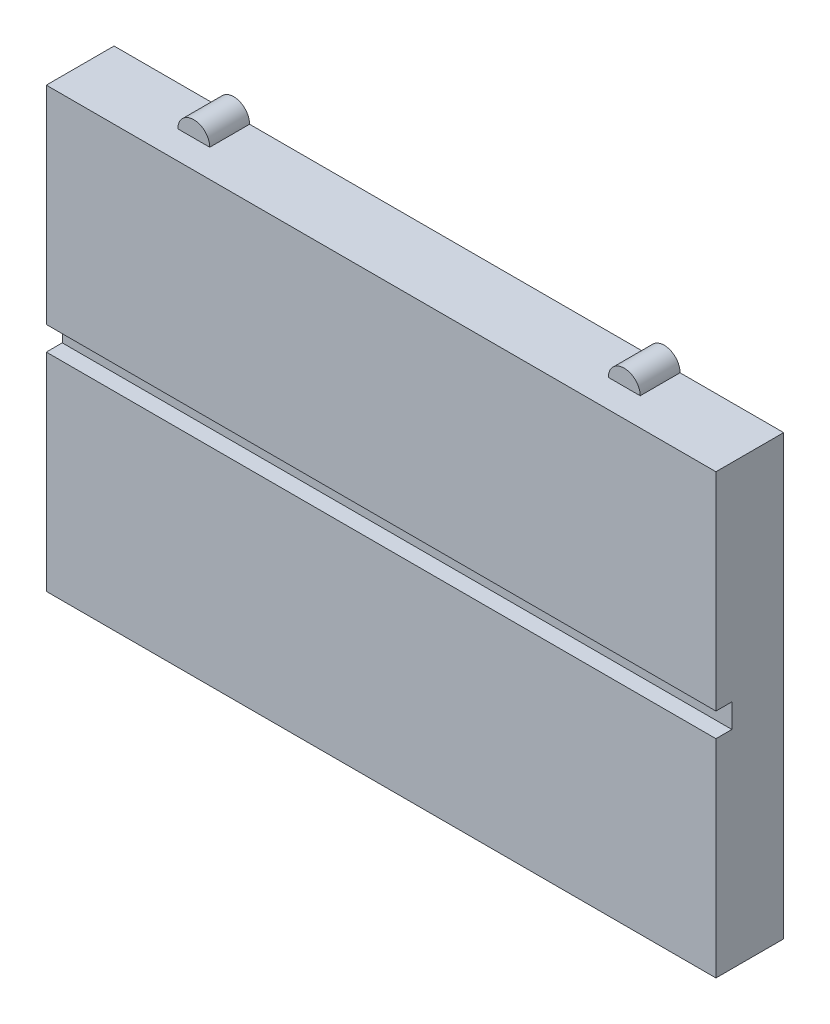
ISO-10303-21;
HEADER;
FILE_DESCRIPTION(('STEP AP214'),'2;1');
FILE_NAME('part.step','',(''),(''),'','','');
FILE_SCHEMA(('AUTOMOTIVE_DESIGN { 1 0 10303 214 1 1 1 1 }'));
ENDSEC;
DATA;
#1=APPLICATION_CONTEXT('core data for automotive mechanical design processes');
#2=APPLICATION_PROTOCOL_DEFINITION('international standard','automotive_design',2000,#1);
#3=PRODUCT_CONTEXT('',#1,'mechanical');
#4=PRODUCT('Part','Part','',(#3));
#5=PRODUCT_RELATED_PRODUCT_CATEGORY('part','',(#4));
#6=PRODUCT_DEFINITION_FORMATION('','',#4);
#7=PRODUCT_DEFINITION_CONTEXT('part definition',#1,'design');
#8=PRODUCT_DEFINITION('design','',#6,#7);
#9=PRODUCT_DEFINITION_SHAPE('','',#8);
#10=(LENGTH_UNIT() NAMED_UNIT(*) SI_UNIT(.MILLI.,.METRE.));
#11=(NAMED_UNIT(*) PLANE_ANGLE_UNIT() SI_UNIT($,.RADIAN.));
#12=(NAMED_UNIT(*) SI_UNIT($,.STERADIAN.) SOLID_ANGLE_UNIT());
#13=UNCERTAINTY_MEASURE_WITH_UNIT(LENGTH_MEASURE(1.E-05),#10,'distance_accuracy_value','');
#14=(GEOMETRIC_REPRESENTATION_CONTEXT(3) GLOBAL_UNCERTAINTY_ASSIGNED_CONTEXT((#13)) GLOBAL_UNIT_ASSIGNED_CONTEXT((#10,
#11,#12)) REPRESENTATION_CONTEXT('',''));
#15=CARTESIAN_POINT('',(0.,0.,0.));
#16=DIRECTION('',(0.,0.,1.));
#17=DIRECTION('',(1.,0.,0.));
#18=AXIS2_PLACEMENT_3D('',#15,#16,#17);
#19=CARTESIAN_POINT('',(0.,0.,8.5));
#20=DIRECTION('',(0.,0.,1.));
#21=DIRECTION('',(1.,0.,0.));
#22=AXIS2_PLACEMENT_3D('',#19,#20,#21);
#23=PLANE('',#22);
#24=DIRECTION('',(-1.,0.,0.));
#25=VECTOR('',#24,1.);
#26=CARTESIAN_POINT('',(42.,1.5,8.5));
#27=LINE('',#26,#25);
#28=CARTESIAN_POINT('',(42.,1.5,8.5));
#29=VERTEX_POINT('',#28);
#30=CARTESIAN_POINT('',(-42.,1.5,8.5));
#31=VERTEX_POINT('',#30);
#32=EDGE_CURVE('E189',#29,#31,#27,.T.);
#33=ORIENTED_EDGE('',*,*,#32,.F.);
#34=DIRECTION('',(0.,1.,0.));
#35=VECTOR('',#34,1.);
#36=CARTESIAN_POINT('',(42.,0.,8.5));
#37=LINE('',#36,#35);
#38=CARTESIAN_POINT('',(42.,27.5,8.5));
#39=VERTEX_POINT('',#38);
#40=EDGE_CURVE('E300',#29,#39,#37,.T.);
#41=ORIENTED_EDGE('',*,*,#40,.T.);
#42=DIRECTION('',(-1.,0.,0.));
#43=VECTOR('',#42,1.);
#44=CARTESIAN_POINT('',(0.,27.5,8.5));
#45=LINE('',#44,#43);
#46=CARTESIAN_POINT('',(-42.,27.5,8.5));
#47=VERTEX_POINT('',#46);
#48=EDGE_CURVE('E305',#39,#47,#45,.T.);
#49=ORIENTED_EDGE('',*,*,#48,.T.);
#50=DIRECTION('',(0.,1.,0.));
#51=VECTOR('',#50,1.);
#52=CARTESIAN_POINT('',(-42.,0.,8.5));
#53=LINE('',#52,#51);
#54=EDGE_CURVE('E296',#31,#47,#53,.T.);
#55=ORIENTED_EDGE('',*,*,#54,.F.);
#56=EDGE_LOOP('',(#33,#41,#49,#55));
#57=FACE_BOUND('',#56,.T.);
#58=ADVANCED_FACE('F46',(#57),#23,.T.);
#59=CARTESIAN_POINT('',(0.,27.5,8.5));
#60=DIRECTION('',(0.,-1.,0.));
#61=DIRECTION('',(1.,0.,0.));
#62=AXIS2_PLACEMENT_3D('',#59,#60,#61);
#63=PLANE('',#62);
#64=DIRECTION('',(0.,0.,-1.));
#65=VECTOR('',#64,1.);
#66=CARTESIAN_POINT('',(25.,27.5,5.));
#67=LINE('',#66,#65);
#68=CARTESIAN_POINT('',(25.,27.5,5.));
#69=VERTEX_POINT('',#68);
#70=CARTESIAN_POINT('',(25.,27.5,0.));
#71=VERTEX_POINT('',#70);
#72=EDGE_CURVE('E209',#69,#71,#67,.T.);
#73=ORIENTED_EDGE('',*,*,#72,.T.);
#74=DIRECTION('',(-1.,0.,0.));
#75=VECTOR('',#74,1.);
#76=CARTESIAN_POINT('',(0.,27.5,0.));
#77=LINE('',#76,#75);
#78=CARTESIAN_POINT('',(-25.,27.5,0.));
#79=VERTEX_POINT('',#78);
#80=EDGE_CURVE('E326',#71,#79,#77,.T.);
#81=ORIENTED_EDGE('',*,*,#80,.T.);
#82=DIRECTION('',(0.,0.,-1.));
#83=VECTOR('',#82,1.);
#84=CARTESIAN_POINT('',(-25.,27.5,5.));
#85=LINE('',#84,#83);
#86=CARTESIAN_POINT('',(-25.,27.5,5.));
#87=VERTEX_POINT('',#86);
#88=EDGE_CURVE('E288',#87,#79,#85,.T.);
#89=ORIENTED_EDGE('',*,*,#88,.F.);
#90=DIRECTION('',(-1.,0.,0.));
#91=VECTOR('',#90,1.);
#92=CARTESIAN_POINT('',(0.,27.5,5.));
#93=LINE('',#92,#91);
#94=CARTESIAN_POINT('',(-29.,27.5,5.));
#95=VERTEX_POINT('',#94);
#96=EDGE_CURVE('E274',#87,#95,#93,.T.);
#97=ORIENTED_EDGE('',*,*,#96,.T.);
#98=DIRECTION('',(0.,0.,-1.));
#99=VECTOR('',#98,1.);
#100=CARTESIAN_POINT('',(-29.,27.5,5.));
#101=LINE('',#100,#99);
#102=CARTESIAN_POINT('',(-29.,27.5,0.));
#103=VERTEX_POINT('',#102);
#104=EDGE_CURVE('E281',#95,#103,#101,.T.);
#105=ORIENTED_EDGE('',*,*,#104,.T.);
#106=CARTESIAN_POINT('',(-42.,27.5,0.));
#107=VERTEX_POINT('',#106);
#108=EDGE_CURVE('E322',#103,#107,#77,.T.);
#109=ORIENTED_EDGE('',*,*,#108,.T.);
#110=DIRECTION('',(0.,0.,-1.));
#111=VECTOR('',#110,1.);
#112=CARTESIAN_POINT('',(-42.,27.5,8.5));
#113=LINE('',#112,#111);
#114=EDGE_CURVE('E309',#47,#107,#113,.T.);
#115=ORIENTED_EDGE('',*,*,#114,.F.);
#116=ORIENTED_EDGE('',*,*,#48,.F.);
#117=DIRECTION('',(0.,0.,-1.));
#118=VECTOR('',#117,1.);
#119=CARTESIAN_POINT('',(42.,27.5,8.5));
#120=LINE('',#119,#118);
#121=CARTESIAN_POINT('',(42.,27.5,0.));
#122=VERTEX_POINT('',#121);
#123=EDGE_CURVE('E330',#39,#122,#120,.T.);
#124=ORIENTED_EDGE('',*,*,#123,.T.);
#125=CARTESIAN_POINT('',(29.,27.5,0.));
#126=VERTEX_POINT('',#125);
#127=EDGE_CURVE('E323',#122,#126,#77,.T.);
#128=ORIENTED_EDGE('',*,*,#127,.T.);
#129=DIRECTION('',(0.,0.,-1.));
#130=VECTOR('',#129,1.);
#131=CARTESIAN_POINT('',(29.,27.5,5.));
#132=LINE('',#131,#130);
#133=CARTESIAN_POINT('',(29.,27.5,5.));
#134=VERTEX_POINT('',#133);
#135=EDGE_CURVE('E216',#134,#126,#132,.T.);
#136=ORIENTED_EDGE('',*,*,#135,.F.);
#137=DIRECTION('',(-1.,0.,0.));
#138=VECTOR('',#137,1.);
#139=CARTESIAN_POINT('',(0.,27.5,5.));
#140=LINE('',#139,#138);
#141=EDGE_CURVE('E70',#134,#69,#140,.T.);
#142=ORIENTED_EDGE('',*,*,#141,.T.);
#143=EDGE_LOOP('',(#73,#81,#89,#97,#105,#109,#115,#116,#124,#128,#136,#142));
#144=FACE_BOUND('',#143,.T.);
#145=ADVANCED_FACE('F369',(#144),#63,.F.);
#146=CARTESIAN_POINT('',(-42.,0.,8.5));
#147=DIRECTION('',(-1.,0.,0.));
#148=DIRECTION('',(0.,0.,1.));
#149=AXIS2_PLACEMENT_3D('',#146,#147,#148);
#150=PLANE('',#149);
#151=DIRECTION('',(0.,0.,1.));
#152=VECTOR('',#151,1.);
#153=CARTESIAN_POINT('',(-42.,1.5,6.5));
#154=LINE('',#153,#152);
#155=CARTESIAN_POINT('',(-42.,1.5,6.5));
#156=VERTEX_POINT('',#155);
#157=EDGE_CURVE('E213',#156,#31,#154,.T.);
#158=ORIENTED_EDGE('',*,*,#157,.T.);
#159=ORIENTED_EDGE('',*,*,#54,.T.);
#160=ORIENTED_EDGE('',*,*,#114,.T.);
#161=DIRECTION('',(0.,1.,0.));
#162=VECTOR('',#161,1.);
#163=CARTESIAN_POINT('',(-42.,0.,0.));
#164=LINE('',#163,#162);
#165=CARTESIAN_POINT('',(-42.,24.5,0.));
#166=VERTEX_POINT('',#165);
#167=EDGE_CURVE('E292',#166,#107,#164,.T.);
#168=ORIENTED_EDGE('',*,*,#167,.F.);
#169=DIRECTION('',(0.,0.,-1.));
#170=VECTOR('',#169,1.);
#171=CARTESIAN_POINT('',(-42.,24.5,5.));
#172=LINE('',#171,#170);
#173=CARTESIAN_POINT('',(-42.,24.5,5.));
#174=VERTEX_POINT('',#173);
#175=EDGE_CURVE('E270',#174,#166,#172,.T.);
#176=ORIENTED_EDGE('',*,*,#175,.F.);
#177=DIRECTION('',(0.,1.,0.));
#178=VECTOR('',#177,1.);
#179=CARTESIAN_POINT('',(-42.,0.,5.));
#180=LINE('',#179,#178);
#181=CARTESIAN_POINT('',(-42.,20.5,5.));
#182=VERTEX_POINT('',#181);
#183=EDGE_CURVE('E256',#182,#174,#180,.T.);
#184=ORIENTED_EDGE('',*,*,#183,.F.);
#185=DIRECTION('',(0.,0.,-1.));
#186=VECTOR('',#185,1.);
#187=CARTESIAN_POINT('',(-42.,20.5,5.));
#188=LINE('',#187,#186);
#189=CARTESIAN_POINT('',(-42.,20.5,0.));
#190=VERTEX_POINT('',#189);
#191=EDGE_CURVE('E263',#182,#190,#188,.T.);
#192=ORIENTED_EDGE('',*,*,#191,.T.);
#193=CARTESIAN_POINT('',(-42.,2.,0.));
#194=VERTEX_POINT('',#193);
#195=EDGE_CURVE('E359',#194,#190,#164,.T.);
#196=ORIENTED_EDGE('',*,*,#195,.F.);
#197=DIRECTION('',(0.,0.,-1.));
#198=VECTOR('',#197,1.);
#199=CARTESIAN_POINT('',(-42.,2.,5.));
#200=LINE('',#199,#198);
#201=CARTESIAN_POINT('',(-42.,2.,5.));
#202=VERTEX_POINT('',#201);
#203=EDGE_CURVE('E252',#202,#194,#200,.T.);
#204=ORIENTED_EDGE('',*,*,#203,.F.);
#205=DIRECTION('',(0.,1.,0.));
#206=VECTOR('',#205,1.);
#207=CARTESIAN_POINT('',(-42.,0.,5.));
#208=LINE('',#207,#206);
#209=CARTESIAN_POINT('',(-42.,-2.00000000000001,5.));
#210=VERTEX_POINT('',#209);
#211=EDGE_CURVE('E238',#210,#202,#208,.T.);
#212=ORIENTED_EDGE('',*,*,#211,.F.);
#213=DIRECTION('',(0.,0.,-1.));
#214=VECTOR('',#213,1.);
#215=CARTESIAN_POINT('',(-42.,-2.00000000000001,5.));
#216=LINE('',#215,#214);
#217=CARTESIAN_POINT('',(-42.,-2.00000000000001,0.));
#218=VERTEX_POINT('',#217);
#219=EDGE_CURVE('E245',#210,#218,#216,.T.);
#220=ORIENTED_EDGE('',*,*,#219,.T.);
#221=CARTESIAN_POINT('',(-42.,-20.5,0.));
#222=VERTEX_POINT('',#221);
#223=EDGE_CURVE('E315',#222,#218,#164,.T.);
#224=ORIENTED_EDGE('',*,*,#223,.F.);
#225=DIRECTION('',(0.,0.,-1.));
#226=VECTOR('',#225,1.);
#227=CARTESIAN_POINT('',(-42.,-20.5,5.));
#228=LINE('',#227,#226);
#229=CARTESIAN_POINT('',(-42.,-20.5,5.));
#230=VERTEX_POINT('',#229);
#231=EDGE_CURVE('E234',#230,#222,#228,.T.);
#232=ORIENTED_EDGE('',*,*,#231,.F.);
#233=DIRECTION('',(0.,1.,0.));
#234=VECTOR('',#233,1.);
#235=CARTESIAN_POINT('',(-42.,0.,5.));
#236=LINE('',#235,#234);
#237=CARTESIAN_POINT('',(-42.,-24.5,5.));
#238=VERTEX_POINT('',#237);
#239=EDGE_CURVE('E221',#238,#230,#236,.T.);
#240=ORIENTED_EDGE('',*,*,#239,.F.);
#241=DIRECTION('',(0.,0.,-1.));
#242=VECTOR('',#241,1.);
#243=CARTESIAN_POINT('',(-42.,-24.5,5.));
#244=LINE('',#243,#242);
#245=CARTESIAN_POINT('',(-42.,-24.5,0.));
#246=VERTEX_POINT('',#245);
#247=EDGE_CURVE('E228',#238,#246,#244,.T.);
#248=ORIENTED_EDGE('',*,*,#247,.T.);
#249=CARTESIAN_POINT('',(-42.,-27.5,0.));
#250=VERTEX_POINT('',#249);
#251=EDGE_CURVE('E310',#250,#246,#164,.T.);
#252=ORIENTED_EDGE('',*,*,#251,.F.);
#253=DIRECTION('',(0.,0.,-1.));
#254=VECTOR('',#253,1.);
#255=CARTESIAN_POINT('',(-42.,-27.5,8.5));
#256=LINE('',#255,#254);
#257=CARTESIAN_POINT('',(-42.,-27.5,8.5));
#258=VERTEX_POINT('',#257);
#259=EDGE_CURVE('E11',#258,#250,#256,.T.);
#260=ORIENTED_EDGE('',*,*,#259,.F.);
#261=CARTESIAN_POINT('',(-42.,-1.5,8.5));
#262=VERTEX_POINT('',#261);
#263=EDGE_CURVE('E193',#258,#262,#53,.T.);
#264=ORIENTED_EDGE('',*,*,#263,.T.);
#265=DIRECTION('',(0.,0.,1.));
#266=VECTOR('',#265,1.);
#267=CARTESIAN_POINT('',(-42.,-1.5,6.5));
#268=LINE('',#267,#266);
#269=CARTESIAN_POINT('',(-42.,-1.5,6.5));
#270=VERTEX_POINT('',#269);
#271=EDGE_CURVE('E62',#270,#262,#268,.T.);
#272=ORIENTED_EDGE('',*,*,#271,.F.);
#273=DIRECTION('',(0.,-1.,0.));
#274=VECTOR('',#273,1.);
#275=CARTESIAN_POINT('',(-42.,-1.5,6.5));
#276=LINE('',#275,#274);
#277=EDGE_CURVE('E179',#156,#270,#276,.T.);
#278=ORIENTED_EDGE('',*,*,#277,.F.);
#279=EDGE_LOOP('',(#158,#159,#160,#168,#176,#184,#192,#196,#204,#212,#220,#224,#232,#240,#248,
#252,#260,#264,#272,#278));
#280=FACE_BOUND('',#279,.T.);
#281=ADVANCED_FACE('F48',(#280),#150,.T.);
#282=CARTESIAN_POINT('',(0.,-27.5,8.5));
#283=DIRECTION('',(0.,-1.,0.));
#284=DIRECTION('',(1.,0.,0.));
#285=AXIS2_PLACEMENT_3D('',#282,#283,#284);
#286=PLANE('',#285);
#287=DIRECTION('',(-1.,0.,0.));
#288=VECTOR('',#287,1.);
#289=CARTESIAN_POINT('',(0.,-27.5,0.));
#290=LINE('',#289,#288);
#291=CARTESIAN_POINT('',(42.,-27.5,0.));
#292=VERTEX_POINT('',#291);
#293=EDGE_CURVE('E314',#292,#250,#290,.T.);
#294=ORIENTED_EDGE('',*,*,#293,.F.);
#295=DIRECTION('',(0.,0.,-1.));
#296=VECTOR('',#295,1.);
#297=CARTESIAN_POINT('',(42.,-27.5,8.5));
#298=LINE('',#297,#296);
#299=CARTESIAN_POINT('',(42.,-27.5,8.5));
#300=VERTEX_POINT('',#299);
#301=EDGE_CURVE('E55',#300,#292,#298,.T.);
#302=ORIENTED_EDGE('',*,*,#301,.F.);
#303=DIRECTION('',(-1.,0.,0.));
#304=VECTOR('',#303,1.);
#305=CARTESIAN_POINT('',(0.,-27.5,8.5));
#306=LINE('',#305,#304);
#307=EDGE_CURVE('E295',#300,#258,#306,.T.);
#308=ORIENTED_EDGE('',*,*,#307,.T.);
#309=ORIENTED_EDGE('',*,*,#259,.T.);
#310=EDGE_LOOP('',(#294,#302,#308,#309));
#311=FACE_BOUND('',#310,.T.);
#312=ADVANCED_FACE('F347',(#311),#286,.T.);
#313=CARTESIAN_POINT('',(42.,0.,8.5));
#314=DIRECTION('',(-1.,0.,0.));
#315=DIRECTION('',(0.,0.,1.));
#316=AXIS2_PLACEMENT_3D('',#313,#314,#315);
#317=PLANE('',#316);
#318=ORIENTED_EDGE('',*,*,#40,.F.);
#319=DIRECTION('',(0.,0.,1.));
#320=VECTOR('',#319,1.);
#321=CARTESIAN_POINT('',(42.,1.5,6.5));
#322=LINE('',#321,#320);
#323=CARTESIAN_POINT('',(42.,1.5,6.5));
#324=VERTEX_POINT('',#323);
#325=EDGE_CURVE('E198',#324,#29,#322,.T.);
#326=ORIENTED_EDGE('',*,*,#325,.F.);
#327=DIRECTION('',(0.,1.,0.));
#328=VECTOR('',#327,1.);
#329=CARTESIAN_POINT('',(42.,-1.5,6.5));
#330=LINE('',#329,#328);
#331=CARTESIAN_POINT('',(42.,-1.5,6.5));
#332=VERTEX_POINT('',#331);
#333=EDGE_CURVE('E178',#332,#324,#330,.T.);
#334=ORIENTED_EDGE('',*,*,#333,.F.);
#335=DIRECTION('',(0.,0.,1.));
#336=VECTOR('',#335,1.);
#337=CARTESIAN_POINT('',(42.,-1.5,6.5));
#338=LINE('',#337,#336);
#339=CARTESIAN_POINT('',(42.,-1.5,8.5));
#340=VERTEX_POINT('',#339);
#341=EDGE_CURVE('E174',#332,#340,#338,.T.);
#342=ORIENTED_EDGE('',*,*,#341,.T.);
#343=EDGE_CURVE('E301',#300,#340,#37,.T.);
#344=ORIENTED_EDGE('',*,*,#343,.F.);
#345=ORIENTED_EDGE('',*,*,#301,.T.);
#346=DIRECTION('',(0.,1.,0.));
#347=VECTOR('',#346,1.);
#348=CARTESIAN_POINT('',(42.,0.,0.));
#349=LINE('',#348,#347);
#350=EDGE_CURVE('E319',#292,#122,#349,.T.);
#351=ORIENTED_EDGE('',*,*,#350,.T.);
#352=ORIENTED_EDGE('',*,*,#123,.F.);
#353=EDGE_LOOP('',(#318,#326,#334,#342,#344,#345,#351,#352));
#354=FACE_BOUND('',#353,.T.);
#355=ADVANCED_FACE('F338',(#354),#317,.F.);
#356=DIRECTION('',(1.,0.,0.));
#357=VECTOR('',#356,1.);
#358=CARTESIAN_POINT('',(42.,-1.5,8.5));
#359=LINE('',#358,#357);
#360=EDGE_CURVE('E413',#262,#340,#359,.T.);
#361=ORIENTED_EDGE('',*,*,#360,.F.);
#362=ORIENTED_EDGE('',*,*,#263,.F.);
#363=ORIENTED_EDGE('',*,*,#307,.F.);
#364=ORIENTED_EDGE('',*,*,#343,.T.);
#365=EDGE_LOOP('',(#361,#362,#363,#364));
#366=FACE_BOUND('',#365,.T.);
#367=ADVANCED_FACE('F400',(#366),#23,.T.);
#368=CARTESIAN_POINT('',(0.,0.,0.));
#369=DIRECTION('',(0.,0.,1.));
#370=DIRECTION('',(1.,0.,0.));
#371=AXIS2_PLACEMENT_3D('',#368,#369,#370);
#372=PLANE('',#371);
#373=ORIENTED_EDGE('',*,*,#251,.T.);
#374=CARTESIAN_POINT('',(-42.,-22.5,0.));
#375=DIRECTION('',(0.,0.,1.));
#376=DIRECTION('',(1.,0.,0.));
#377=AXIS2_PLACEMENT_3D('',#374,#375,#376);
#378=CIRCLE('',#377,2.);
#379=EDGE_CURVE('E220',#222,#246,#378,.T.);
#380=ORIENTED_EDGE('',*,*,#379,.F.);
#381=ORIENTED_EDGE('',*,*,#223,.T.);
#382=CARTESIAN_POINT('',(-42.,0.,0.));
#383=DIRECTION('',(0.,0.,1.));
#384=DIRECTION('',(1.,0.,0.));
#385=AXIS2_PLACEMENT_3D('',#382,#383,#384);
#386=CIRCLE('',#385,2.);
#387=EDGE_CURVE('E237',#194,#218,#386,.T.);
#388=ORIENTED_EDGE('',*,*,#387,.F.);
#389=ORIENTED_EDGE('',*,*,#195,.T.);
#390=CARTESIAN_POINT('',(-42.,22.5,0.));
#391=DIRECTION('',(0.,0.,1.));
#392=DIRECTION('',(1.,0.,0.));
#393=AXIS2_PLACEMENT_3D('',#390,#391,#392);
#394=CIRCLE('',#393,2.);
#395=EDGE_CURVE('E255',#166,#190,#394,.T.);
#396=ORIENTED_EDGE('',*,*,#395,.F.);
#397=ORIENTED_EDGE('',*,*,#167,.T.);
#398=ORIENTED_EDGE('',*,*,#108,.F.);
#399=CARTESIAN_POINT('',(-27.,27.5,0.));
#400=DIRECTION('',(0.,0.,1.));
#401=DIRECTION('',(1.,0.,0.));
#402=AXIS2_PLACEMENT_3D('',#399,#400,#401);
#403=CIRCLE('',#402,2.);
#404=EDGE_CURVE('E273',#79,#103,#403,.T.);
#405=ORIENTED_EDGE('',*,*,#404,.F.);
#406=ORIENTED_EDGE('',*,*,#80,.F.);
#407=CARTESIAN_POINT('',(27.,27.5,0.));
#408=DIRECTION('',(0.,0.,1.));
#409=DIRECTION('',(1.,0.,0.));
#410=AXIS2_PLACEMENT_3D('',#407,#408,#409);
#411=CIRCLE('',#410,2.);
#412=EDGE_CURVE('E206',#126,#71,#411,.T.);
#413=ORIENTED_EDGE('',*,*,#412,.F.);
#414=ORIENTED_EDGE('',*,*,#127,.F.);
#415=ORIENTED_EDGE('',*,*,#350,.F.);
#416=ORIENTED_EDGE('',*,*,#293,.T.);
#417=EDGE_LOOP('',(#373,#380,#381,#388,#389,#396,#397,#398,#405,#406,#413,#414,#415,#416));
#418=FACE_BOUND('',#417,.T.);
#419=ADVANCED_FACE('F345',(#418),#372,.F.);
#420=CARTESIAN_POINT('',(-27.,27.5,5.));
#421=DIRECTION('',(0.,0.,-1.));
#422=DIRECTION('',(-1.,0.,0.));
#423=AXIS2_PLACEMENT_3D('',#420,#421,#422);
#424=CYLINDRICAL_SURFACE('',#423,2.);
#425=ORIENTED_EDGE('',*,*,#404,.T.);
#426=ORIENTED_EDGE('',*,*,#104,.F.);
#427=CARTESIAN_POINT('',(-27.,27.5,5.));
#428=DIRECTION('',(0.,0.,1.));
#429=DIRECTION('',(1.,0.,0.));
#430=AXIS2_PLACEMENT_3D('',#427,#428,#429);
#431=CIRCLE('',#430,2.);
#432=EDGE_CURVE('E277',#87,#95,#431,.T.);
#433=ORIENTED_EDGE('',*,*,#432,.F.);
#434=ORIENTED_EDGE('',*,*,#88,.T.);
#435=EDGE_LOOP('',(#425,#426,#433,#434));
#436=FACE_BOUND('',#435,.T.);
#437=ADVANCED_FACE('F383',(#436),#424,.T.);
#438=CARTESIAN_POINT('',(0.,0.,5.));
#439=DIRECTION('',(0.,0.,1.));
#440=DIRECTION('',(1.,0.,0.));
#441=AXIS2_PLACEMENT_3D('',#438,#439,#440);
#442=PLANE('',#441);
#443=ORIENTED_EDGE('',*,*,#96,.F.);
#444=ORIENTED_EDGE('',*,*,#432,.T.);
#445=EDGE_LOOP('',(#443,#444));
#446=FACE_BOUND('',#445,.T.);
#447=ADVANCED_FACE('F386',(#446),#442,.T.);
#448=CARTESIAN_POINT('',(-42.,22.5,5.));
#449=DIRECTION('',(0.,0.,-1.));
#450=DIRECTION('',(-1.,0.,0.));
#451=AXIS2_PLACEMENT_3D('',#448,#449,#450);
#452=CYLINDRICAL_SURFACE('',#451,2.);
#453=ORIENTED_EDGE('',*,*,#395,.T.);
#454=ORIENTED_EDGE('',*,*,#191,.F.);
#455=CARTESIAN_POINT('',(-42.,22.5,5.));
#456=DIRECTION('',(0.,0.,1.));
#457=DIRECTION('',(1.,0.,0.));
#458=AXIS2_PLACEMENT_3D('',#455,#456,#457);
#459=CIRCLE('',#458,2.);
#460=EDGE_CURVE('E260',#174,#182,#459,.T.);
#461=ORIENTED_EDGE('',*,*,#460,.F.);
#462=ORIENTED_EDGE('',*,*,#175,.T.);
#463=EDGE_LOOP('',(#453,#454,#461,#462));
#464=FACE_BOUND('',#463,.T.);
#465=ADVANCED_FACE('F388',(#464),#452,.T.);
#466=CARTESIAN_POINT('',(0.,0.,5.));
#467=DIRECTION('',(0.,0.,1.));
#468=DIRECTION('',(1.,0.,0.));
#469=AXIS2_PLACEMENT_3D('',#466,#467,#468);
#470=PLANE('',#469);
#471=ORIENTED_EDGE('',*,*,#183,.T.);
#472=ORIENTED_EDGE('',*,*,#460,.T.);
#473=EDGE_LOOP('',(#471,#472));
#474=FACE_BOUND('',#473,.T.);
#475=ADVANCED_FACE('F394',(#474),#470,.T.);
#476=CARTESIAN_POINT('',(-42.,0.,5.));
#477=DIRECTION('',(0.,0.,-1.));
#478=DIRECTION('',(-1.,0.,0.));
#479=AXIS2_PLACEMENT_3D('',#476,#477,#478);
#480=CYLINDRICAL_SURFACE('',#479,2.);
#481=ORIENTED_EDGE('',*,*,#387,.T.);
#482=ORIENTED_EDGE('',*,*,#219,.F.);
#483=CARTESIAN_POINT('',(-42.,0.,5.));
#484=DIRECTION('',(0.,0.,1.));
#485=DIRECTION('',(1.,0.,0.));
#486=AXIS2_PLACEMENT_3D('',#483,#484,#485);
#487=CIRCLE('',#486,2.);
#488=EDGE_CURVE('E242',#202,#210,#487,.T.);
#489=ORIENTED_EDGE('',*,*,#488,.F.);
#490=ORIENTED_EDGE('',*,*,#203,.T.);
#491=EDGE_LOOP('',(#481,#482,#489,#490));
#492=FACE_BOUND('',#491,.T.);
#493=ADVANCED_FACE('F450',(#492),#480,.T.);
#494=CARTESIAN_POINT('',(0.,0.,5.));
#495=DIRECTION('',(0.,0.,1.));
#496=DIRECTION('',(1.,0.,0.));
#497=AXIS2_PLACEMENT_3D('',#494,#495,#496);
#498=PLANE('',#497);
#499=ORIENTED_EDGE('',*,*,#211,.T.);
#500=ORIENTED_EDGE('',*,*,#488,.T.);
#501=EDGE_LOOP('',(#499,#500));
#502=FACE_BOUND('',#501,.T.);
#503=ADVANCED_FACE('F447',(#502),#498,.T.);
#504=CARTESIAN_POINT('',(-42.,-22.5,5.));
#505=DIRECTION('',(0.,0.,-1.));
#506=DIRECTION('',(-1.,0.,0.));
#507=AXIS2_PLACEMENT_3D('',#504,#505,#506);
#508=CYLINDRICAL_SURFACE('',#507,2.);
#509=ORIENTED_EDGE('',*,*,#379,.T.);
#510=ORIENTED_EDGE('',*,*,#247,.F.);
#511=CARTESIAN_POINT('',(-42.,-22.5,5.));
#512=DIRECTION('',(0.,0.,1.));
#513=DIRECTION('',(1.,0.,0.));
#514=AXIS2_PLACEMENT_3D('',#511,#512,#513);
#515=CIRCLE('',#514,2.);
#516=EDGE_CURVE('E225',#230,#238,#515,.T.);
#517=ORIENTED_EDGE('',*,*,#516,.F.);
#518=ORIENTED_EDGE('',*,*,#231,.T.);
#519=EDGE_LOOP('',(#509,#510,#517,#518));
#520=FACE_BOUND('',#519,.T.);
#521=ADVANCED_FACE('F443',(#520),#508,.T.);
#522=CARTESIAN_POINT('',(0.,0.,5.));
#523=DIRECTION('',(0.,0.,1.));
#524=DIRECTION('',(1.,0.,0.));
#525=AXIS2_PLACEMENT_3D('',#522,#523,#524);
#526=PLANE('',#525);
#527=ORIENTED_EDGE('',*,*,#239,.T.);
#528=ORIENTED_EDGE('',*,*,#516,.T.);
#529=EDGE_LOOP('',(#527,#528));
#530=FACE_BOUND('',#529,.T.);
#531=ADVANCED_FACE('F439',(#530),#526,.T.);
#532=CARTESIAN_POINT('',(27.,27.5,5.));
#533=DIRECTION('',(0.,0.,-1.));
#534=DIRECTION('',(-1.,0.,0.));
#535=AXIS2_PLACEMENT_3D('',#532,#533,#534);
#536=CYLINDRICAL_SURFACE('',#535,2.);
#537=ORIENTED_EDGE('',*,*,#412,.T.);
#538=ORIENTED_EDGE('',*,*,#72,.F.);
#539=CARTESIAN_POINT('',(27.,27.5,5.));
#540=DIRECTION('',(0.,0.,1.));
#541=DIRECTION('',(1.,0.,0.));
#542=AXIS2_PLACEMENT_3D('',#539,#540,#541);
#543=CIRCLE('',#542,2.);
#544=EDGE_CURVE('E205',#134,#69,#543,.T.);
#545=ORIENTED_EDGE('',*,*,#544,.F.);
#546=ORIENTED_EDGE('',*,*,#135,.T.);
#547=EDGE_LOOP('',(#537,#538,#545,#546));
#548=FACE_BOUND('',#547,.T.);
#549=ADVANCED_FACE('F432',(#548),#536,.T.);
#550=CARTESIAN_POINT('',(0.,0.,5.));
#551=DIRECTION('',(0.,0.,1.));
#552=DIRECTION('',(1.,0.,0.));
#553=AXIS2_PLACEMENT_3D('',#550,#551,#552);
#554=PLANE('',#553);
#555=ORIENTED_EDGE('',*,*,#141,.F.);
#556=ORIENTED_EDGE('',*,*,#544,.T.);
#557=EDGE_LOOP('',(#555,#556));
#558=FACE_BOUND('',#557,.T.);
#559=ADVANCED_FACE('F425',(#558),#554,.T.);
#560=CARTESIAN_POINT('',(42.,1.5,6.5));
#561=DIRECTION('',(0.,1.,0.));
#562=DIRECTION('',(0.,0.,1.));
#563=AXIS2_PLACEMENT_3D('',#560,#561,#562);
#564=PLANE('',#563);
#565=ORIENTED_EDGE('',*,*,#32,.T.);
#566=ORIENTED_EDGE('',*,*,#157,.F.);
#567=DIRECTION('',(-1.,0.,0.));
#568=VECTOR('',#567,1.);
#569=CARTESIAN_POINT('',(42.,1.5,6.5));
#570=LINE('',#569,#568);
#571=EDGE_CURVE('E185',#324,#156,#570,.T.);
#572=ORIENTED_EDGE('',*,*,#571,.F.);
#573=ORIENTED_EDGE('',*,*,#325,.T.);
#574=EDGE_LOOP('',(#565,#566,#572,#573));
#575=FACE_BOUND('',#574,.T.);
#576=ADVANCED_FACE('F423',(#575),#564,.F.);
#577=CARTESIAN_POINT('',(42.,-1.5,6.5));
#578=DIRECTION('',(0.,-1.,0.));
#579=DIRECTION('',(0.,0.,-1.));
#580=AXIS2_PLACEMENT_3D('',#577,#578,#579);
#581=PLANE('',#580);
#582=ORIENTED_EDGE('',*,*,#360,.T.);
#583=ORIENTED_EDGE('',*,*,#341,.F.);
#584=DIRECTION('',(1.,0.,0.));
#585=VECTOR('',#584,1.);
#586=CARTESIAN_POINT('',(42.,-1.5,6.5));
#587=LINE('',#586,#585);
#588=EDGE_CURVE('E170',#270,#332,#587,.T.);
#589=ORIENTED_EDGE('',*,*,#588,.F.);
#590=ORIENTED_EDGE('',*,*,#271,.T.);
#591=EDGE_LOOP('',(#582,#583,#589,#590));
#592=FACE_BOUND('',#591,.T.);
#593=ADVANCED_FACE('F172',(#592),#581,.F.);
#594=CARTESIAN_POINT('',(0.,0.,6.5));
#595=DIRECTION('',(0.,0.,1.));
#596=DIRECTION('',(1.,0.,0.));
#597=AXIS2_PLACEMENT_3D('',#594,#595,#596);
#598=PLANE('',#597);
#599=ORIENTED_EDGE('',*,*,#277,.T.);
#600=ORIENTED_EDGE('',*,*,#588,.T.);
#601=ORIENTED_EDGE('',*,*,#333,.T.);
#602=ORIENTED_EDGE('',*,*,#571,.T.);
#603=EDGE_LOOP('',(#599,#600,#601,#602));
#604=FACE_BOUND('',#603,.T.);
#605=ADVANCED_FACE('F183',(#604),#598,.T.);
#606=CLOSED_SHELL('',(#58,#145,#281,#312,#355,#367,#419,#437,#447,#465,#475,#493,#503,#521,#531,
#549,#559,#576,#593,#605));
#607=MANIFOLD_SOLID_BREP('B2',#606);
#608=ADVANCED_BREP_SHAPE_REPRESENTATION('',(#18,#607),#14);
#609=SHAPE_DEFINITION_REPRESENTATION(#9,#608);
ENDSEC;
END-ISO-10303-21;
